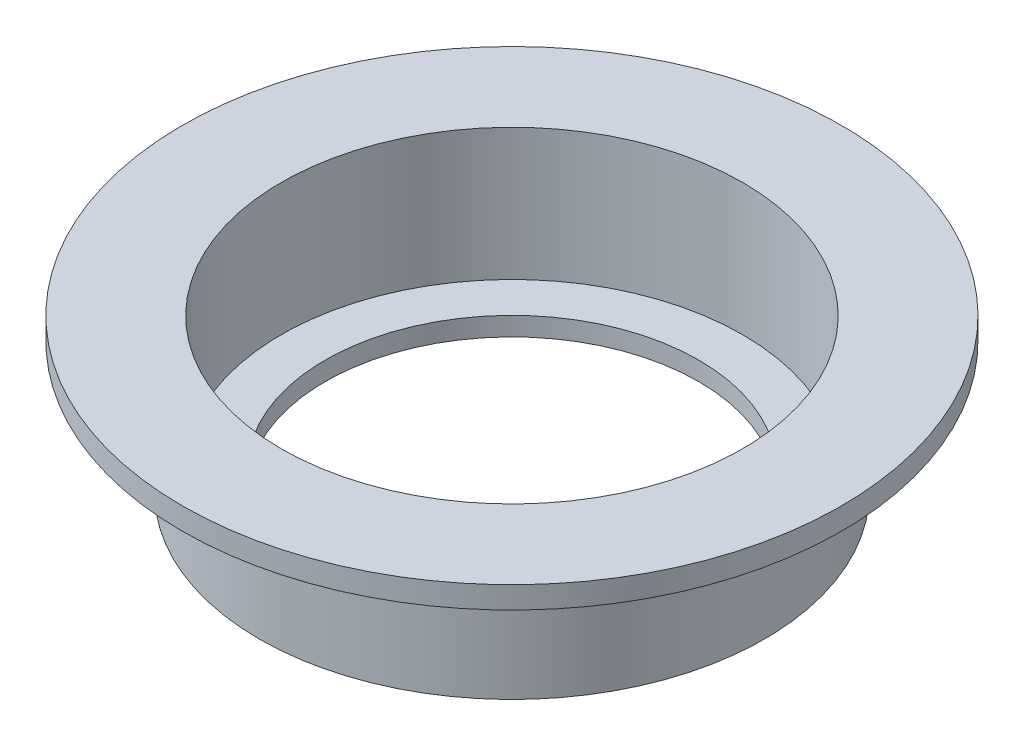
ISO-10303-21;
HEADER;
FILE_DESCRIPTION(('STEP AP214'),'2;1');
FILE_NAME('part.step','',(''),(''),'','','');
FILE_SCHEMA(('AUTOMOTIVE_DESIGN { 1 0 10303 214 1 1 1 1 }'));
ENDSEC;
DATA;
#1=APPLICATION_CONTEXT('core data for automotive mechanical design processes');
#2=APPLICATION_PROTOCOL_DEFINITION('international standard','automotive_design',2000,#1);
#3=PRODUCT_CONTEXT('',#1,'mechanical');
#4=PRODUCT('Part','Part','',(#3));
#5=PRODUCT_RELATED_PRODUCT_CATEGORY('part','',(#4));
#6=PRODUCT_DEFINITION_FORMATION('','',#4);
#7=PRODUCT_DEFINITION_CONTEXT('part definition',#1,'design');
#8=PRODUCT_DEFINITION('design','',#6,#7);
#9=PRODUCT_DEFINITION_SHAPE('','',#8);
#10=(LENGTH_UNIT() NAMED_UNIT(*) SI_UNIT(.MILLI.,.METRE.));
#11=(NAMED_UNIT(*) PLANE_ANGLE_UNIT() SI_UNIT($,.RADIAN.));
#12=(NAMED_UNIT(*) SI_UNIT($,.STERADIAN.) SOLID_ANGLE_UNIT());
#13=UNCERTAINTY_MEASURE_WITH_UNIT(LENGTH_MEASURE(1.E-05),#10,'distance_accuracy_value','');
#14=(GEOMETRIC_REPRESENTATION_CONTEXT(3) GLOBAL_UNCERTAINTY_ASSIGNED_CONTEXT((#13)) GLOBAL_UNIT_ASSIGNED_CONTEXT((#10,
#11,#12)) REPRESENTATION_CONTEXT('',''));
#15=CARTESIAN_POINT('',(0.,0.,0.));
#16=DIRECTION('',(0.,0.,1.));
#17=DIRECTION('',(1.,0.,0.));
#18=AXIS2_PLACEMENT_3D('',#15,#16,#17);
#19=CARTESIAN_POINT('',(0.,11.2232142857143,0.));
#20=DIRECTION('',(0.,1.,0.));
#21=DIRECTION('',(0.,0.,1.));
#22=AXIS2_PLACEMENT_3D('',#19,#20,#21);
#23=CYLINDRICAL_SURFACE('',#22,15.);
#24=CARTESIAN_POINT('',(0.,3.175,0.));
#25=DIRECTION('',(0.,1.,0.));
#26=DIRECTION('',(0.,0.,1.));
#27=AXIS2_PLACEMENT_3D('',#24,#25,#26);
#28=CIRCLE('',#27,15.);
#29=CARTESIAN_POINT('',(0.,3.175,15.));
#30=VERTEX_POINT('',#29);
#31=EDGE_CURVE('E80',#30,#30,#28,.T.);
#32=ORIENTED_EDGE('',*,*,#31,.F.);
#33=EDGE_LOOP('',(#32));
#34=FACE_BOUND('',#33,.T.);
#35=CARTESIAN_POINT('',(0.,2.175,0.));
#36=DIRECTION('',(0.,1.,0.));
#37=DIRECTION('',(0.,0.,1.));
#38=AXIS2_PLACEMENT_3D('',#35,#36,#37);
#39=CIRCLE('',#38,15.);
#40=CARTESIAN_POINT('',(0.,2.175,15.));
#41=VERTEX_POINT('',#40);
#42=EDGE_CURVE('E10',#41,#41,#39,.T.);
#43=ORIENTED_EDGE('',*,*,#42,.T.);
#44=EDGE_LOOP('',(#43));
#45=FACE_BOUND('',#44,.T.);
#46=ADVANCED_FACE('F37',(#34,#45),#23,.T.);
#47=CARTESIAN_POINT('',(15.,2.175,0.));
#48=DIRECTION('',(0.,1.,0.));
#49=DIRECTION('',(0.,0.,1.));
#50=AXIS2_PLACEMENT_3D('',#47,#48,#49);
#51=PLANE('',#50);
#52=ORIENTED_EDGE('',*,*,#42,.F.);
#53=EDGE_LOOP('',(#52));
#54=FACE_BOUND('',#53,.T.);
#55=CARTESIAN_POINT('',(0.,2.175,0.));
#56=DIRECTION('',(0.,1.,0.));
#57=DIRECTION('',(0.,0.,1.));
#58=AXIS2_PLACEMENT_3D('',#55,#56,#57);
#59=CIRCLE('',#58,11.5);
#60=CARTESIAN_POINT('',(0.,2.175,11.5));
#61=VERTEX_POINT('',#60);
#62=EDGE_CURVE('E44',#61,#61,#59,.T.);
#63=ORIENTED_EDGE('',*,*,#62,.T.);
#64=EDGE_LOOP('',(#63));
#65=FACE_BOUND('',#64,.T.);
#66=ADVANCED_FACE('F88',(#54,#65),#51,.F.);
#67=CARTESIAN_POINT('',(0.,11.2232142857143,0.));
#68=DIRECTION('',(0.,1.,0.));
#69=DIRECTION('',(0.,0.,1.));
#70=AXIS2_PLACEMENT_3D('',#67,#68,#69);
#71=CYLINDRICAL_SURFACE('',#70,11.5);
#72=ORIENTED_EDGE('',*,*,#62,.F.);
#73=EDGE_LOOP('',(#72));
#74=FACE_BOUND('',#73,.T.);
#75=CARTESIAN_POINT('',(0.,-3.825,0.));
#76=DIRECTION('',(0.,1.,0.));
#77=DIRECTION('',(0.,0.,1.));
#78=AXIS2_PLACEMENT_3D('',#75,#76,#77);
#79=CIRCLE('',#78,11.5);
#80=CARTESIAN_POINT('',(0.,-3.825,11.5));
#81=VERTEX_POINT('',#80);
#82=EDGE_CURVE('E49',#81,#81,#79,.T.);
#83=ORIENTED_EDGE('',*,*,#82,.T.);
#84=EDGE_LOOP('',(#83));
#85=FACE_BOUND('',#84,.T.);
#86=ADVANCED_FACE('F92',(#74,#85),#71,.T.);
#87=CARTESIAN_POINT('',(11.5,-3.825,0.));
#88=DIRECTION('',(0.,1.,0.));
#89=DIRECTION('',(0.,0.,1.));
#90=AXIS2_PLACEMENT_3D('',#87,#88,#89);
#91=PLANE('',#90);
#92=ORIENTED_EDGE('',*,*,#82,.F.);
#93=EDGE_LOOP('',(#92));
#94=FACE_BOUND('',#93,.T.);
#95=CARTESIAN_POINT('',(0.,-3.825,0.));
#96=DIRECTION('',(0.,1.,0.));
#97=DIRECTION('',(0.,0.,1.));
#98=AXIS2_PLACEMENT_3D('',#95,#96,#97);
#99=CIRCLE('',#98,10.5);
#100=CARTESIAN_POINT('',(0.,-3.825,10.5));
#101=VERTEX_POINT('',#100);
#102=EDGE_CURVE('E54',#101,#101,#99,.T.);
#103=ORIENTED_EDGE('',*,*,#102,.T.);
#104=EDGE_LOOP('',(#103));
#105=FACE_BOUND('',#104,.T.);
#106=ADVANCED_FACE('F97',(#94,#105),#91,.F.);
#107=CARTESIAN_POINT('',(0.,11.2232142857143,0.));
#108=DIRECTION('',(0.,1.,0.));
#109=DIRECTION('',(0.,0.,1.));
#110=AXIS2_PLACEMENT_3D('',#107,#108,#109);
#111=CYLINDRICAL_SURFACE('',#110,10.5);
#112=ORIENTED_EDGE('',*,*,#102,.F.);
#113=EDGE_LOOP('',(#112));
#114=FACE_BOUND('',#113,.T.);
#115=CARTESIAN_POINT('',(0.,-3.675,0.));
#116=DIRECTION('',(0.,1.,0.));
#117=DIRECTION('',(0.,0.,1.));
#118=AXIS2_PLACEMENT_3D('',#115,#116,#117);
#119=CIRCLE('',#118,10.5);
#120=CARTESIAN_POINT('',(0.,-3.675,10.5));
#121=VERTEX_POINT('',#120);
#122=EDGE_CURVE('E60',#121,#121,#119,.T.);
#123=ORIENTED_EDGE('',*,*,#122,.T.);
#124=EDGE_LOOP('',(#123));
#125=FACE_BOUND('',#124,.T.);
#126=ADVANCED_FACE('F103',(#114,#125),#111,.F.);
#127=CARTESIAN_POINT('',(10.5,-3.675,0.));
#128=DIRECTION('',(0.,1.,0.));
#129=DIRECTION('',(0.,0.,1.));
#130=AXIS2_PLACEMENT_3D('',#127,#128,#129);
#131=PLANE('',#130);
#132=ORIENTED_EDGE('',*,*,#122,.F.);
#133=EDGE_LOOP('',(#132));
#134=FACE_BOUND('',#133,.T.);
#135=CARTESIAN_POINT('',(0.,-3.675,0.));
#136=DIRECTION('',(0.,1.,0.));
#137=DIRECTION('',(0.,0.,1.));
#138=AXIS2_PLACEMENT_3D('',#135,#136,#137);
#139=CIRCLE('',#138,8.5);
#140=CARTESIAN_POINT('',(0.,-3.675,8.5));
#141=VERTEX_POINT('',#140);
#142=EDGE_CURVE('E64',#141,#141,#139,.T.);
#143=ORIENTED_EDGE('',*,*,#142,.T.);
#144=EDGE_LOOP('',(#143));
#145=FACE_BOUND('',#144,.T.);
#146=ADVANCED_FACE('F107',(#134,#145),#131,.F.);
#147=CARTESIAN_POINT('',(0.,11.2232142857143,0.));
#148=DIRECTION('',(0.,1.,0.));
#149=DIRECTION('',(0.,0.,1.));
#150=AXIS2_PLACEMENT_3D('',#147,#148,#149);
#151=CYLINDRICAL_SURFACE('',#150,8.5);
#152=ORIENTED_EDGE('',*,*,#142,.F.);
#153=EDGE_LOOP('',(#152));
#154=FACE_BOUND('',#153,.T.);
#155=CARTESIAN_POINT('',(0.,-2.825,0.));
#156=DIRECTION('',(0.,1.,0.));
#157=DIRECTION('',(0.,0.,1.));
#158=AXIS2_PLACEMENT_3D('',#155,#156,#157);
#159=CIRCLE('',#158,8.5);
#160=CARTESIAN_POINT('',(0.,-2.825,8.5));
#161=VERTEX_POINT('',#160);
#162=EDGE_CURVE('E68',#161,#161,#159,.T.);
#163=ORIENTED_EDGE('',*,*,#162,.T.);
#164=EDGE_LOOP('',(#163));
#165=FACE_BOUND('',#164,.T.);
#166=ADVANCED_FACE('F111',(#154,#165),#151,.F.);
#167=CARTESIAN_POINT('',(8.5,-2.825,0.));
#168=DIRECTION('',(0.,-1.,0.));
#169=DIRECTION('',(0.,0.,-1.));
#170=AXIS2_PLACEMENT_3D('',#167,#168,#169);
#171=PLANE('',#170);
#172=ORIENTED_EDGE('',*,*,#162,.F.);
#173=EDGE_LOOP('',(#172));
#174=FACE_BOUND('',#173,.T.);
#175=CARTESIAN_POINT('',(0.,-2.825,0.));
#176=DIRECTION('',(0.,1.,0.));
#177=DIRECTION('',(0.,0.,1.));
#178=AXIS2_PLACEMENT_3D('',#175,#176,#177);
#179=CIRCLE('',#178,10.5);
#180=CARTESIAN_POINT('',(0.,-2.825,10.5));
#181=VERTEX_POINT('',#180);
#182=EDGE_CURVE('E72',#181,#181,#179,.T.);
#183=ORIENTED_EDGE('',*,*,#182,.T.);
#184=EDGE_LOOP('',(#183));
#185=FACE_BOUND('',#184,.T.);
#186=ADVANCED_FACE('F115',(#174,#185),#171,.F.);
#187=CARTESIAN_POINT('',(0.,11.2232142857143,0.));
#188=DIRECTION('',(0.,1.,0.));
#189=DIRECTION('',(0.,0.,1.));
#190=AXIS2_PLACEMENT_3D('',#187,#188,#189);
#191=CYLINDRICAL_SURFACE('',#190,10.5);
#192=ORIENTED_EDGE('',*,*,#182,.F.);
#193=EDGE_LOOP('',(#192));
#194=FACE_BOUND('',#193,.T.);
#195=CARTESIAN_POINT('',(0.,3.175,0.));
#196=DIRECTION('',(0.,1.,0.));
#197=DIRECTION('',(0.,0.,1.));
#198=AXIS2_PLACEMENT_3D('',#195,#196,#197);
#199=CIRCLE('',#198,10.5);
#200=CARTESIAN_POINT('',(0.,3.175,10.5));
#201=VERTEX_POINT('',#200);
#202=EDGE_CURVE('E76',#201,#201,#199,.T.);
#203=ORIENTED_EDGE('',*,*,#202,.T.);
#204=EDGE_LOOP('',(#203));
#205=FACE_BOUND('',#204,.T.);
#206=ADVANCED_FACE('F119',(#194,#205),#191,.F.);
#207=CARTESIAN_POINT('',(15.,3.175,0.));
#208=DIRECTION('',(0.,-1.,0.));
#209=DIRECTION('',(0.,0.,-1.));
#210=AXIS2_PLACEMENT_3D('',#207,#208,#209);
#211=PLANE('',#210);
#212=ORIENTED_EDGE('',*,*,#202,.F.);
#213=EDGE_LOOP('',(#212));
#214=FACE_BOUND('',#213,.T.);
#215=ORIENTED_EDGE('',*,*,#31,.T.);
#216=EDGE_LOOP('',(#215));
#217=FACE_BOUND('',#216,.T.);
#218=ADVANCED_FACE('F85',(#214,#217),#211,.F.);
#219=CLOSED_SHELL('',(#46,#66,#86,#106,#126,#146,#166,#186,#206,#218));
#220=MANIFOLD_SOLID_BREP('B2',#219);
#221=ADVANCED_BREP_SHAPE_REPRESENTATION('',(#18,#220),#14);
#222=SHAPE_DEFINITION_REPRESENTATION(#9,#221);
ENDSEC;
END-ISO-10303-21;
